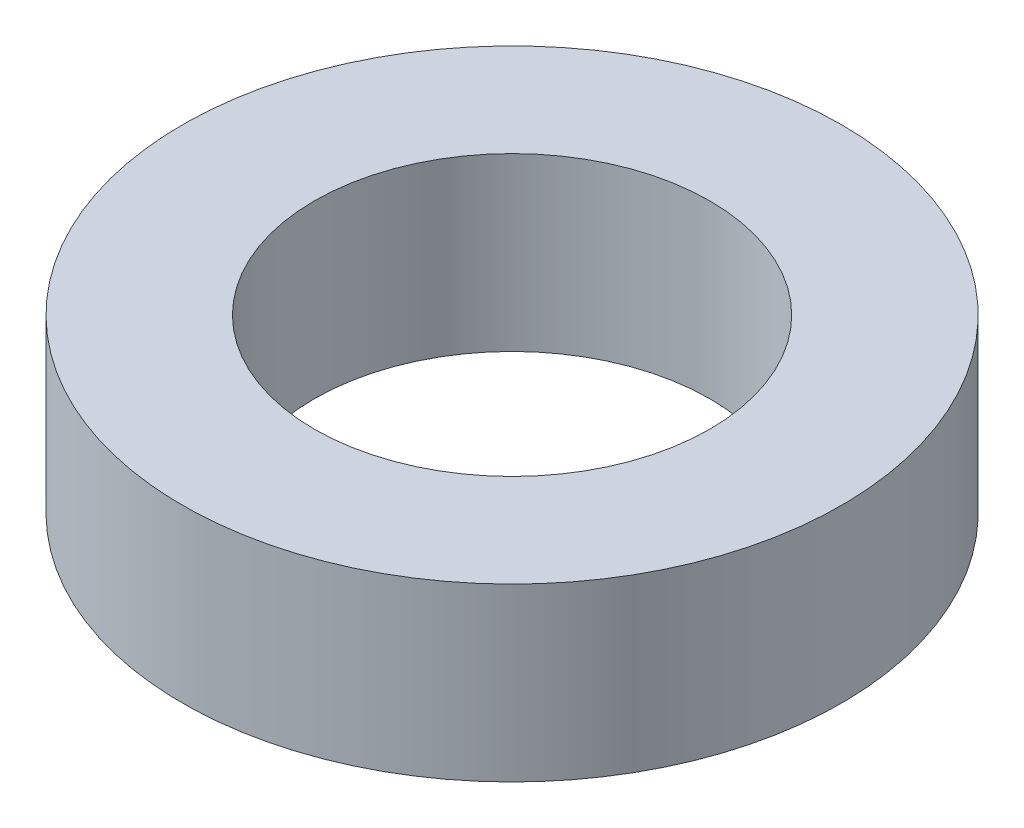
ISO-10303-21;
HEADER;
FILE_DESCRIPTION(('STEP AP214'),'2;1');
FILE_NAME('part.step','',(''),(''),'','','');
FILE_SCHEMA(('AUTOMOTIVE_DESIGN { 1 0 10303 214 1 1 1 1 }'));
ENDSEC;
DATA;
#1=APPLICATION_CONTEXT('core data for automotive mechanical design processes');
#2=APPLICATION_PROTOCOL_DEFINITION('international standard','automotive_design',2000,#1);
#3=PRODUCT_CONTEXT('',#1,'mechanical');
#4=PRODUCT('Part','Part','',(#3));
#5=PRODUCT_RELATED_PRODUCT_CATEGORY('part','',(#4));
#6=PRODUCT_DEFINITION_FORMATION('','',#4);
#7=PRODUCT_DEFINITION_CONTEXT('part definition',#1,'design');
#8=PRODUCT_DEFINITION('design','',#6,#7);
#9=PRODUCT_DEFINITION_SHAPE('','',#8);
#10=(LENGTH_UNIT() NAMED_UNIT(*) SI_UNIT(.MILLI.,.METRE.));
#11=(NAMED_UNIT(*) PLANE_ANGLE_UNIT() SI_UNIT($,.RADIAN.));
#12=(NAMED_UNIT(*) SI_UNIT($,.STERADIAN.) SOLID_ANGLE_UNIT());
#13=UNCERTAINTY_MEASURE_WITH_UNIT(LENGTH_MEASURE(1.E-05),#10,'distance_accuracy_value','');
#14=(GEOMETRIC_REPRESENTATION_CONTEXT(3) GLOBAL_UNCERTAINTY_ASSIGNED_CONTEXT((#13)) GLOBAL_UNIT_ASSIGNED_CONTEXT((#10,
#11,#12)) REPRESENTATION_CONTEXT('',''));
#15=CARTESIAN_POINT('',(0.,0.,0.));
#16=DIRECTION('',(0.,0.,1.));
#17=DIRECTION('',(1.,0.,0.));
#18=AXIS2_PLACEMENT_3D('',#15,#16,#17);
#19=CARTESIAN_POINT('',(0.,26.,0.));
#20=DIRECTION('',(0.,-1.,0.));
#21=DIRECTION('',(0.,0.,-1.));
#22=AXIS2_PLACEMENT_3D('',#19,#20,#21);
#23=CYLINDRICAL_SURFACE('',#22,50.);
#24=CARTESIAN_POINT('',(0.,26.,0.));
#25=DIRECTION('',(0.,1.,0.));
#26=DIRECTION('',(0.,0.,1.));
#27=AXIS2_PLACEMENT_3D('',#24,#25,#26);
#28=CIRCLE('',#27,50.);
#29=CARTESIAN_POINT('',(0.,26.,-50.));
#30=VERTEX_POINT('',#29);
#31=EDGE_CURVE('E10',#30,#30,#28,.T.);
#32=CARTESIAN_POINT('',(0.,0.,0.));
#33=DIRECTION('',(0.,1.,0.));
#34=DIRECTION('',(0.,0.,1.));
#35=AXIS2_PLACEMENT_3D('',#32,#33,#34);
#36=CIRCLE('',#35,50.);
#37=CARTESIAN_POINT('',(0.,0.,-50.));
#38=VERTEX_POINT('',#37);
#39=EDGE_CURVE('E37',#38,#38,#36,.T.);
#40=CARTESIAN_POINT('',(0.,26.,-50.));
#41=CARTESIAN_POINT('',(0.,25.7291666666667,-50.));
#42=CARTESIAN_POINT('',(0.,25.4583333333333,-50.));
#43=CARTESIAN_POINT('',(0.,24.9166666666667,-50.));
#44=CARTESIAN_POINT('',(0.,24.6458333333333,-50.));
#45=CARTESIAN_POINT('',(0.,24.1041666666667,-50.));
#46=CARTESIAN_POINT('',(0.,23.8333333333333,-50.));
#47=CARTESIAN_POINT('',(0.,23.2916666666667,-50.));
#48=CARTESIAN_POINT('',(0.,23.0208333333333,-50.));
#49=CARTESIAN_POINT('',(0.,22.4791666666667,-50.));
#50=CARTESIAN_POINT('',(0.,22.2083333333333,-50.));
#51=CARTESIAN_POINT('',(0.,21.6666666666667,-50.));
#52=CARTESIAN_POINT('',(0.,21.3958333333333,-50.));
#53=CARTESIAN_POINT('',(0.,20.8541666666667,-50.));
#54=CARTESIAN_POINT('',(0.,20.5833333333333,-50.));
#55=CARTESIAN_POINT('',(0.,20.0416666666667,-50.));
#56=CARTESIAN_POINT('',(0.,19.7708333333333,-50.));
#57=CARTESIAN_POINT('',(0.,19.2291666666667,-50.));
#58=CARTESIAN_POINT('',(0.,18.9583333333333,-50.));
#59=CARTESIAN_POINT('',(0.,18.4166666666667,-50.));
#60=CARTESIAN_POINT('',(0.,18.1458333333333,-50.));
#61=CARTESIAN_POINT('',(0.,17.6041666666667,-50.));
#62=CARTESIAN_POINT('',(0.,17.3333333333333,-50.));
#63=CARTESIAN_POINT('',(0.,16.7916666666667,-50.));
#64=CARTESIAN_POINT('',(0.,16.5208333333333,-50.));
#65=CARTESIAN_POINT('',(0.,15.9791666666667,-50.));
#66=CARTESIAN_POINT('',(0.,15.7083333333333,-50.));
#67=CARTESIAN_POINT('',(0.,15.1666666666667,-50.));
#68=CARTESIAN_POINT('',(0.,14.8958333333333,-50.));
#69=CARTESIAN_POINT('',(0.,14.3541666666667,-50.));
#70=CARTESIAN_POINT('',(0.,14.0833333333333,-50.));
#71=CARTESIAN_POINT('',(0.,13.5416666666667,-50.));
#72=CARTESIAN_POINT('',(0.,13.2708333333333,-50.));
#73=CARTESIAN_POINT('',(0.,12.7291666666667,-50.));
#74=CARTESIAN_POINT('',(0.,12.4583333333333,-50.));
#75=CARTESIAN_POINT('',(0.,11.9166666666667,-50.));
#76=CARTESIAN_POINT('',(0.,11.6458333333333,-50.));
#77=CARTESIAN_POINT('',(0.,11.1041666666667,-50.));
#78=CARTESIAN_POINT('',(0.,10.8333333333333,-50.));
#79=CARTESIAN_POINT('',(0.,10.2916666666667,-50.));
#80=CARTESIAN_POINT('',(0.,10.0208333333333,-50.));
#81=CARTESIAN_POINT('',(0.,9.47916666666667,-50.));
#82=CARTESIAN_POINT('',(0.,9.20833333333333,-50.));
#83=CARTESIAN_POINT('',(0.,8.66666666666667,-50.));
#84=CARTESIAN_POINT('',(0.,8.39583333333333,-50.));
#85=CARTESIAN_POINT('',(0.,7.85416666666667,-50.));
#86=CARTESIAN_POINT('',(0.,7.58333333333333,-50.));
#87=CARTESIAN_POINT('',(0.,7.04166666666667,-50.));
#88=CARTESIAN_POINT('',(0.,6.77083333333333,-50.));
#89=CARTESIAN_POINT('',(0.,6.22916666666667,-50.));
#90=CARTESIAN_POINT('',(0.,5.95833333333333,-50.));
#91=CARTESIAN_POINT('',(0.,5.41666666666667,-50.));
#92=CARTESIAN_POINT('',(0.,5.14583333333333,-50.));
#93=CARTESIAN_POINT('',(0.,4.60416666666667,-50.));
#94=CARTESIAN_POINT('',(0.,4.33333333333333,-50.));
#95=CARTESIAN_POINT('',(0.,3.79166666666667,-50.));
#96=CARTESIAN_POINT('',(0.,3.52083333333333,-50.));
#97=CARTESIAN_POINT('',(0.,2.97916666666667,-50.));
#98=CARTESIAN_POINT('',(0.,2.70833333333333,-50.));
#99=CARTESIAN_POINT('',(0.,2.16666666666667,-50.));
#100=CARTESIAN_POINT('',(0.,1.89583333333333,-50.));
#101=CARTESIAN_POINT('',(0.,1.35416666666667,-50.));
#102=CARTESIAN_POINT('',(0.,1.08333333333333,-50.));
#103=CARTESIAN_POINT('',(0.,0.541666666666667,-50.));
#104=CARTESIAN_POINT('',(0.,0.270833333333334,-50.));
#105=CARTESIAN_POINT('',(0.,0.,-50.));
#106=B_SPLINE_CURVE_WITH_KNOTS('',3,(#40,#41,#42,#43,#44,#45,#46,#47,#48,#49,#50,#51,#52,#53,
#54,#55,#56,#57,#58,#59,#60,#61,#62,#63,#64,#65,#66,#67,#68,#69,#70,#71,#72,#73,#74,#75,#76,#77,
#78,#79,#80,#81,#82,#83,#84,#85,#86,#87,#88,#89,#90,#91,#92,#93,#94,#95,#96,#97,#98,#99,#100,
#101,#102,#103,#104,#105),.UNSPECIFIED.,.F.,.F.,(4,2,2,2,2,2,2,2,2,2,2,2,2,2,2,2,2,2,2,2,2,2,2,
2,2,2,2,2,2,2,2,2,4),(0.,0.812499999999997,1.625,2.4375,3.25,4.0625,4.875,5.6875,6.5,7.3125,
8.125,8.93749999999999,9.74999999999999,10.5625,11.375,12.1875,13.,13.8125,14.625,15.4375,16.25,
17.0625,17.875,18.6875,19.5,20.3125,21.125,21.9375,22.75,23.5625,24.375,25.1875,26.),.UNSPECIFIED.);
#107=EDGE_CURVE('BSEAM40',#30,#38,#106,.T.);
#108=ORIENTED_EDGE('',*,*,#31,.F.);
#109=ORIENTED_EDGE('',*,*,#39,.T.);
#110=ORIENTED_EDGE('',*,*,#107,.T.);
#111=ORIENTED_EDGE('',*,*,#107,.F.);
#112=EDGE_LOOP('',(#108,#110,#109,#111));
#113=FACE_BOUND('',#112,.T.);
#114=ADVANCED_FACE('F40',(#113),#23,.T.);
#115=CARTESIAN_POINT('',(0.,26.,0.));
#116=DIRECTION('',(0.,1.,0.));
#117=DIRECTION('',(0.,0.,1.));
#118=AXIS2_PLACEMENT_3D('',#115,#116,#117);
#119=PLANE('',#118);
#120=CARTESIAN_POINT('',(0.,26.,0.));
#121=DIRECTION('',(0.,1.,0.));
#122=DIRECTION('',(0.,0.,1.));
#123=AXIS2_PLACEMENT_3D('',#120,#121,#122);
#124=CIRCLE('',#123,30.);
#125=CARTESIAN_POINT('',(0.,26.,-30.));
#126=VERTEX_POINT('',#125);
#127=EDGE_CURVE('E50',#126,#126,#124,.T.);
#128=ORIENTED_EDGE('',*,*,#127,.F.);
#129=EDGE_LOOP('',(#128));
#130=FACE_BOUND('',#129,.T.);
#131=ORIENTED_EDGE('',*,*,#31,.T.);
#132=EDGE_LOOP('',(#131));
#133=FACE_BOUND('',#132,.T.);
#134=ADVANCED_FACE('F59',(#130,#133),#119,.T.);
#135=CARTESIAN_POINT('',(0.,0.,0.));
#136=DIRECTION('',(0.,1.,0.));
#137=DIRECTION('',(0.,0.,1.));
#138=AXIS2_PLACEMENT_3D('',#135,#136,#137);
#139=PLANE('',#138);
#140=CARTESIAN_POINT('',(0.,0.,0.));
#141=DIRECTION('',(0.,1.,0.));
#142=DIRECTION('',(0.,0.,1.));
#143=AXIS2_PLACEMENT_3D('',#140,#141,#142);
#144=CIRCLE('',#143,30.);
#145=CARTESIAN_POINT('',(0.,0.,-30.));
#146=VERTEX_POINT('',#145);
#147=EDGE_CURVE('E47',#146,#146,#144,.T.);
#148=ORIENTED_EDGE('',*,*,#147,.T.);
#149=EDGE_LOOP('',(#148));
#150=FACE_BOUND('',#149,.T.);
#151=ORIENTED_EDGE('',*,*,#39,.F.);
#152=EDGE_LOOP('',(#151));
#153=FACE_BOUND('',#152,.T.);
#154=ADVANCED_FACE('F58',(#150,#153),#139,.F.);
#155=CARTESIAN_POINT('',(0.,26.,0.));
#156=DIRECTION('',(0.,-1.,0.));
#157=DIRECTION('',(0.,0.,-1.));
#158=AXIS2_PLACEMENT_3D('',#155,#156,#157);
#159=CYLINDRICAL_SURFACE('',#158,30.);
#160=CARTESIAN_POINT('',(0.,26.,-30.));
#161=CARTESIAN_POINT('',(0.,25.7291666666667,-30.));
#162=CARTESIAN_POINT('',(0.,25.4583333333333,-30.));
#163=CARTESIAN_POINT('',(0.,24.9166666666667,-30.));
#164=CARTESIAN_POINT('',(0.,24.6458333333333,-30.));
#165=CARTESIAN_POINT('',(0.,24.1041666666667,-30.));
#166=CARTESIAN_POINT('',(0.,23.8333333333333,-30.));
#167=CARTESIAN_POINT('',(0.,23.2916666666667,-30.));
#168=CARTESIAN_POINT('',(0.,23.0208333333333,-30.));
#169=CARTESIAN_POINT('',(0.,22.4791666666667,-30.));
#170=CARTESIAN_POINT('',(0.,22.2083333333333,-30.));
#171=CARTESIAN_POINT('',(0.,21.6666666666667,-30.));
#172=CARTESIAN_POINT('',(0.,21.3958333333333,-30.));
#173=CARTESIAN_POINT('',(0.,20.8541666666667,-30.));
#174=CARTESIAN_POINT('',(0.,20.5833333333333,-30.));
#175=CARTESIAN_POINT('',(0.,20.0416666666667,-30.));
#176=CARTESIAN_POINT('',(0.,19.7708333333333,-30.));
#177=CARTESIAN_POINT('',(0.,19.2291666666667,-30.));
#178=CARTESIAN_POINT('',(0.,18.9583333333333,-30.));
#179=CARTESIAN_POINT('',(0.,18.4166666666667,-30.));
#180=CARTESIAN_POINT('',(0.,18.1458333333333,-30.));
#181=CARTESIAN_POINT('',(0.,17.6041666666667,-30.));
#182=CARTESIAN_POINT('',(0.,17.3333333333333,-30.));
#183=CARTESIAN_POINT('',(0.,16.7916666666667,-30.));
#184=CARTESIAN_POINT('',(0.,16.5208333333333,-30.));
#185=CARTESIAN_POINT('',(0.,15.9791666666667,-30.));
#186=CARTESIAN_POINT('',(0.,15.7083333333333,-30.));
#187=CARTESIAN_POINT('',(0.,15.1666666666667,-30.));
#188=CARTESIAN_POINT('',(0.,14.8958333333333,-30.));
#189=CARTESIAN_POINT('',(0.,14.3541666666667,-30.));
#190=CARTESIAN_POINT('',(0.,14.0833333333333,-30.));
#191=CARTESIAN_POINT('',(0.,13.5416666666667,-30.));
#192=CARTESIAN_POINT('',(0.,13.2708333333333,-30.));
#193=CARTESIAN_POINT('',(0.,12.7291666666667,-30.));
#194=CARTESIAN_POINT('',(0.,12.4583333333333,-30.));
#195=CARTESIAN_POINT('',(0.,11.9166666666667,-30.));
#196=CARTESIAN_POINT('',(0.,11.6458333333333,-30.));
#197=CARTESIAN_POINT('',(0.,11.1041666666667,-30.));
#198=CARTESIAN_POINT('',(0.,10.8333333333333,-30.));
#199=CARTESIAN_POINT('',(0.,10.2916666666667,-30.));
#200=CARTESIAN_POINT('',(0.,10.0208333333333,-30.));
#201=CARTESIAN_POINT('',(0.,9.47916666666667,-30.));
#202=CARTESIAN_POINT('',(0.,9.20833333333333,-30.));
#203=CARTESIAN_POINT('',(0.,8.66666666666667,-30.));
#204=CARTESIAN_POINT('',(0.,8.39583333333333,-30.));
#205=CARTESIAN_POINT('',(0.,7.85416666666667,-30.));
#206=CARTESIAN_POINT('',(0.,7.58333333333333,-30.));
#207=CARTESIAN_POINT('',(0.,7.04166666666667,-30.));
#208=CARTESIAN_POINT('',(0.,6.77083333333333,-30.));
#209=CARTESIAN_POINT('',(0.,6.22916666666667,-30.));
#210=CARTESIAN_POINT('',(0.,5.95833333333333,-30.));
#211=CARTESIAN_POINT('',(0.,5.41666666666667,-30.));
#212=CARTESIAN_POINT('',(0.,5.14583333333333,-30.));
#213=CARTESIAN_POINT('',(0.,4.60416666666667,-30.));
#214=CARTESIAN_POINT('',(0.,4.33333333333333,-30.));
#215=CARTESIAN_POINT('',(0.,3.79166666666667,-30.));
#216=CARTESIAN_POINT('',(0.,3.52083333333333,-30.));
#217=CARTESIAN_POINT('',(0.,2.97916666666667,-30.));
#218=CARTESIAN_POINT('',(0.,2.70833333333333,-30.));
#219=CARTESIAN_POINT('',(0.,2.16666666666667,-30.));
#220=CARTESIAN_POINT('',(0.,1.89583333333333,-30.));
#221=CARTESIAN_POINT('',(0.,1.35416666666667,-30.));
#222=CARTESIAN_POINT('',(0.,1.08333333333333,-30.));
#223=CARTESIAN_POINT('',(0.,0.541666666666667,-30.));
#224=CARTESIAN_POINT('',(0.,0.270833333333334,-30.));
#225=CARTESIAN_POINT('',(0.,0.,-30.));
#226=B_SPLINE_CURVE_WITH_KNOTS('',3,(#160,#161,#162,#163,#164,#165,#166,#167,#168,#169,#170,
#171,#172,#173,#174,#175,#176,#177,#178,#179,#180,#181,#182,#183,#184,#185,#186,#187,#188,#189,
#190,#191,#192,#193,#194,#195,#196,#197,#198,#199,#200,#201,#202,#203,#204,#205,#206,#207,#208,
#209,#210,#211,#212,#213,#214,#215,#216,#217,#218,#219,#220,#221,#222,#223,#224,#225),
.UNSPECIFIED.,.F.,.F.,(4,2,2,2,2,2,2,2,2,2,2,2,2,2,2,2,2,2,2,2,2,2,2,2,2,2,2,2,2,2,2,2,4),(0.,
0.812500000000001,1.625,2.4375,3.25,4.0625,4.875,5.6875,6.5,7.3125,8.125,8.9375,9.75,10.5625,
11.375,12.1875,13.,13.8125,14.625,15.4375,16.25,17.0625,17.875,18.6875,19.5,20.3125,21.125,
21.9375,22.75,23.5625,24.375,25.1875,26.),.UNSPECIFIED.);
#227=EDGE_CURVE('BSEAM54',#126,#146,#226,.T.);
#228=ORIENTED_EDGE('',*,*,#127,.T.);
#229=ORIENTED_EDGE('',*,*,#147,.F.);
#230=ORIENTED_EDGE('',*,*,#227,.T.);
#231=ORIENTED_EDGE('',*,*,#227,.F.);
#232=EDGE_LOOP('',(#228,#230,#229,#231));
#233=FACE_BOUND('',#232,.T.);
#234=ADVANCED_FACE('F54',(#233),#159,.F.);
#235=CLOSED_SHELL('',(#114,#134,#154,#234));
#236=MANIFOLD_SOLID_BREP('B2',#235);
#237=ADVANCED_BREP_SHAPE_REPRESENTATION('',(#18,#236),#14);
#238=SHAPE_DEFINITION_REPRESENTATION(#9,#237);
ENDSEC;
END-ISO-10303-21;
